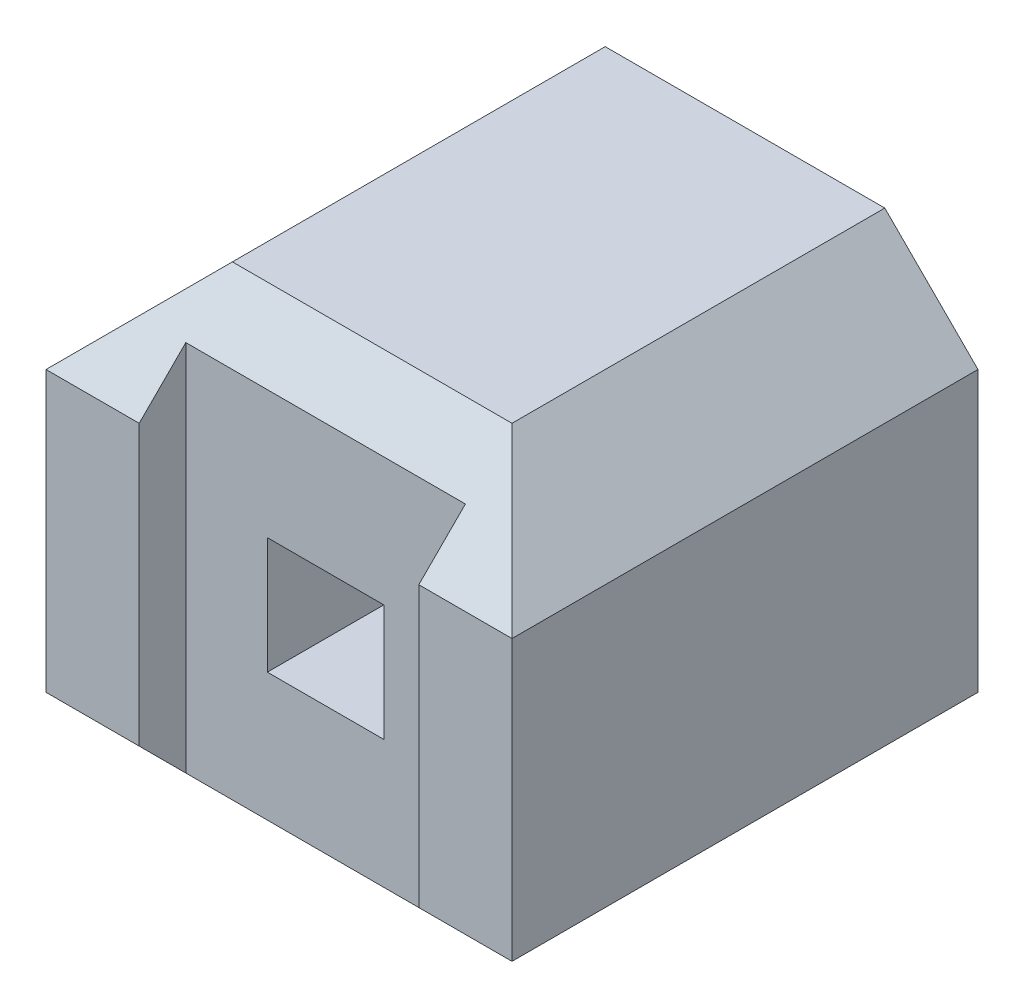
ISO-10303-21;
HEADER;
FILE_DESCRIPTION(('STEP AP214'),'2;1');
FILE_NAME('part.step','',(''),(''),'','','');
FILE_SCHEMA(('AUTOMOTIVE_DESIGN { 1 0 10303 214 1 1 1 1 }'));
ENDSEC;
DATA;
#1=APPLICATION_CONTEXT('core data for automotive mechanical design processes');
#2=APPLICATION_PROTOCOL_DEFINITION('international standard','automotive_design',2000,#1);
#3=PRODUCT_CONTEXT('',#1,'mechanical');
#4=PRODUCT('Part','Part','',(#3));
#5=PRODUCT_RELATED_PRODUCT_CATEGORY('part','',(#4));
#6=PRODUCT_DEFINITION_FORMATION('','',#4);
#7=PRODUCT_DEFINITION_CONTEXT('part definition',#1,'design');
#8=PRODUCT_DEFINITION('design','',#6,#7);
#9=PRODUCT_DEFINITION_SHAPE('','',#8);
#10=(LENGTH_UNIT() NAMED_UNIT(*) SI_UNIT(.MILLI.,.METRE.));
#11=(NAMED_UNIT(*) PLANE_ANGLE_UNIT() SI_UNIT($,.RADIAN.));
#12=(NAMED_UNIT(*) SI_UNIT($,.STERADIAN.) SOLID_ANGLE_UNIT());
#13=UNCERTAINTY_MEASURE_WITH_UNIT(LENGTH_MEASURE(1.E-05),#10,'distance_accuracy_value','');
#14=(GEOMETRIC_REPRESENTATION_CONTEXT(3) GLOBAL_UNCERTAINTY_ASSIGNED_CONTEXT((#13)) GLOBAL_UNIT_ASSIGNED_CONTEXT((#10,
#11,#12)) REPRESENTATION_CONTEXT('',''));
#15=CARTESIAN_POINT('',(0.,0.,0.));
#16=DIRECTION('',(0.,0.,1.));
#17=DIRECTION('',(1.,0.,0.));
#18=AXIS2_PLACEMENT_3D('',#15,#16,#17);
#19=CARTESIAN_POINT('',(1.27,-1.27,2.54));
#20=DIRECTION('',(-1.,0.,0.));
#21=DIRECTION('',(0.,0.,1.));
#22=AXIS2_PLACEMENT_3D('',#19,#20,#21);
#23=PLANE('',#22);
#24=DIRECTION('',(0.,0.,1.));
#25=VECTOR('',#24,1.);
#26=CARTESIAN_POINT('',(1.27,0.762,2.54));
#27=LINE('',#26,#25);
#28=CARTESIAN_POINT('',(1.27,0.762,0.));
#29=VERTEX_POINT('',#28);
#30=CARTESIAN_POINT('',(1.27,0.762,2.54));
#31=VERTEX_POINT('',#30);
#32=EDGE_CURVE('E158',#29,#31,#27,.T.);
#33=ORIENTED_EDGE('',*,*,#32,.T.);
#34=DIRECTION('',(0.,1.,0.));
#35=VECTOR('',#34,1.);
#36=CARTESIAN_POINT('',(1.27,0.,2.54));
#37=LINE('',#36,#35);
#38=CARTESIAN_POINT('',(1.27,-0.762,2.54));
#39=VERTEX_POINT('',#38);
#40=EDGE_CURVE('E127',#39,#31,#37,.T.);
#41=ORIENTED_EDGE('',*,*,#40,.F.);
#42=DIRECTION('',(0.,0.,1.));
#43=VECTOR('',#42,1.);
#44=CARTESIAN_POINT('',(1.27,-0.762,2.54));
#45=LINE('',#44,#43);
#46=CARTESIAN_POINT('',(1.27,-0.762,0.));
#47=VERTEX_POINT('',#46);
#48=EDGE_CURVE('E151',#39,#47,#45,.F.);
#49=ORIENTED_EDGE('',*,*,#48,.T.);
#50=DIRECTION('',(0.,1.,0.));
#51=VECTOR('',#50,1.);
#52=CARTESIAN_POINT('',(1.27,-1.27,0.));
#53=LINE('',#52,#51);
#54=EDGE_CURVE('E19',#29,#47,#53,.F.);
#55=ORIENTED_EDGE('',*,*,#54,.F.);
#56=EDGE_LOOP('',(#33,#41,#49,#55));
#57=FACE_BOUND('',#56,.T.);
#58=ADVANCED_FACE('F16',(#57),#23,.F.);
#59=CARTESIAN_POINT('',(0.,0.,2.54));
#60=DIRECTION('',(0.,0.,1.));
#61=DIRECTION('',(1.,0.,0.));
#62=AXIS2_PLACEMENT_3D('',#59,#60,#61);
#63=PLANE('',#62);
#64=ORIENTED_EDGE('',*,*,#40,.T.);
#65=DIRECTION('',(1.,0.,0.));
#66=VECTOR('',#65,1.);
#67=CARTESIAN_POINT('',(0.,0.762,2.54));
#68=LINE('',#67,#66);
#69=CARTESIAN_POINT('',(0.762,0.762,2.54));
#70=VERTEX_POINT('',#69);
#71=EDGE_CURVE('E155',#31,#70,#68,.F.);
#72=ORIENTED_EDGE('',*,*,#71,.T.);
#73=DIRECTION('',(0.,-1.,0.));
#74=VECTOR('',#73,1.);
#75=CARTESIAN_POINT('',(0.762,1.27,2.54));
#76=LINE('',#75,#74);
#77=CARTESIAN_POINT('',(0.762,-0.762,2.54));
#78=VERTEX_POINT('',#77);
#79=EDGE_CURVE('E134',#78,#70,#76,.F.);
#80=ORIENTED_EDGE('',*,*,#79,.F.);
#81=DIRECTION('',(1.,0.,0.));
#82=VECTOR('',#81,1.);
#83=CARTESIAN_POINT('',(0.,-0.762,2.54));
#84=LINE('',#83,#82);
#85=EDGE_CURVE('E130',#78,#39,#84,.T.);
#86=ORIENTED_EDGE('',*,*,#85,.T.);
#87=EDGE_LOOP('',(#64,#72,#80,#86));
#88=FACE_BOUND('',#87,.T.);
#89=ADVANCED_FACE('F132',(#88),#63,.T.);
#90=CARTESIAN_POINT('',(1.27,-0.762,2.54));
#91=DIRECTION('',(-0.707106781186548,0.707106781186547,0.));
#92=DIRECTION('',(-0.707106781186547,-0.707106781186548,0.));
#93=AXIS2_PLACEMENT_3D('',#90,#91,#92);
#94=PLANE('',#93);
#95=ORIENTED_EDGE('',*,*,#48,.F.);
#96=DIRECTION('',(0.577350269189626,0.577350269189625,0.577350269189626));
#97=VECTOR('',#96,1.);
#98=CARTESIAN_POINT('',(0.762,-1.27,2.032));
#99=LINE('',#98,#97);
#100=CARTESIAN_POINT('',(0.762,-1.27,2.032));
#101=VERTEX_POINT('',#100);
#102=EDGE_CURVE('E138',#101,#39,#99,.T.);
#103=ORIENTED_EDGE('',*,*,#102,.F.);
#104=DIRECTION('',(0.,0.,1.));
#105=VECTOR('',#104,1.);
#106=CARTESIAN_POINT('',(0.762,-1.27,2.54));
#107=LINE('',#106,#105);
#108=CARTESIAN_POINT('',(0.762,-1.27,0.));
#109=VERTEX_POINT('',#108);
#110=EDGE_CURVE('E182',#101,#109,#107,.F.);
#111=ORIENTED_EDGE('',*,*,#110,.T.);
#112=DIRECTION('',(-0.707106781186547,-0.707106781186548,0.));
#113=VECTOR('',#112,1.);
#114=CARTESIAN_POINT('',(1.27,-0.762,0.));
#115=LINE('',#114,#113);
#116=EDGE_CURVE('E153',#47,#109,#115,.T.);
#117=ORIENTED_EDGE('',*,*,#116,.F.);
#118=EDGE_LOOP('',(#95,#103,#111,#117));
#119=FACE_BOUND('',#118,.T.);
#120=ADVANCED_FACE('F152',(#119),#94,.F.);
#121=CARTESIAN_POINT('',(0.762,1.27,2.54));
#122=DIRECTION('',(-0.707106781186548,-0.707106781186547,0.));
#123=DIRECTION('',(0.707106781186547,-0.707106781186548,0.));
#124=AXIS2_PLACEMENT_3D('',#121,#122,#123);
#125=PLANE('',#124);
#126=DIRECTION('',(0.,0.,-1.));
#127=VECTOR('',#126,1.);
#128=CARTESIAN_POINT('',(0.762,1.27,2.54));
#129=LINE('',#128,#127);
#130=CARTESIAN_POINT('',(0.762,1.27,0.));
#131=VERTEX_POINT('',#130);
#132=CARTESIAN_POINT('',(0.762,1.27,2.032));
#133=VERTEX_POINT('',#132);
#134=EDGE_CURVE('E186',#131,#133,#129,.F.);
#135=ORIENTED_EDGE('',*,*,#134,.T.);
#136=DIRECTION('',(-0.577350269189625,0.577350269189626,-0.577350269189626));
#137=VECTOR('',#136,1.);
#138=CARTESIAN_POINT('',(1.27,0.762,2.54));
#139=LINE('',#138,#137);
#140=EDGE_CURVE('E165',#31,#133,#139,.T.);
#141=ORIENTED_EDGE('',*,*,#140,.F.);
#142=ORIENTED_EDGE('',*,*,#32,.F.);
#143=DIRECTION('',(0.707106781186547,-0.707106781186548,0.));
#144=VECTOR('',#143,1.);
#145=CARTESIAN_POINT('',(0.762,1.27,0.));
#146=LINE('',#145,#144);
#147=EDGE_CURVE('E167',#131,#29,#146,.T.);
#148=ORIENTED_EDGE('',*,*,#147,.F.);
#149=EDGE_LOOP('',(#135,#141,#142,#148));
#150=FACE_BOUND('',#149,.T.);
#151=ADVANCED_FACE('F357',(#150),#125,.F.);
#152=CARTESIAN_POINT('',(0.762,1.27,2.286));
#153=DIRECTION('',(-1.,0.,0.));
#154=DIRECTION('',(0.,-1.,0.));
#155=AXIS2_PLACEMENT_3D('',#152,#153,#154);
#156=PLANE('',#155);
#157=ORIENTED_EDGE('',*,*,#79,.T.);
#158=DIRECTION('',(0.,-0.707106781186547,0.707106781186548));
#159=VECTOR('',#158,1.);
#160=CARTESIAN_POINT('',(0.762,0.762,2.54));
#161=LINE('',#160,#159);
#162=CARTESIAN_POINT('',(0.762,1.016,2.286));
#163=VERTEX_POINT('',#162);
#164=EDGE_CURVE('E196',#163,#70,#161,.T.);
#165=ORIENTED_EDGE('',*,*,#164,.F.);
#166=DIRECTION('',(0.,1.,0.));
#167=VECTOR('',#166,1.);
#168=CARTESIAN_POINT('',(0.762,0.,2.286));
#169=LINE('',#168,#167);
#170=CARTESIAN_POINT('',(0.762,-1.016,2.286));
#171=VERTEX_POINT('',#170);
#172=EDGE_CURVE('E211',#163,#171,#169,.F.);
#173=ORIENTED_EDGE('',*,*,#172,.T.);
#174=DIRECTION('',(0.,-0.707106781186547,-0.707106781186548));
#175=VECTOR('',#174,1.);
#176=CARTESIAN_POINT('',(0.762,-0.762,2.54));
#177=LINE('',#176,#175);
#178=EDGE_CURVE('E146',#78,#171,#177,.T.);
#179=ORIENTED_EDGE('',*,*,#178,.F.);
#180=EDGE_LOOP('',(#157,#165,#173,#179));
#181=FACE_BOUND('',#180,.T.);
#182=ADVANCED_FACE('F292',(#181),#156,.T.);
#183=CARTESIAN_POINT('',(-0.762,-1.27,2.286));
#184=DIRECTION('',(1.,0.,0.));
#185=DIRECTION('',(0.,0.,-1.));
#186=AXIS2_PLACEMENT_3D('',#183,#184,#185);
#187=PLANE('',#186);
#188=DIRECTION('',(0.,1.,0.));
#189=VECTOR('',#188,1.);
#190=CARTESIAN_POINT('',(-0.762,0.,2.286));
#191=LINE('',#190,#189);
#192=CARTESIAN_POINT('',(-0.762,-1.016,2.286));
#193=VERTEX_POINT('',#192);
#194=CARTESIAN_POINT('',(-0.762,1.016,2.286));
#195=VERTEX_POINT('',#194);
#196=EDGE_CURVE('E217',#193,#195,#191,.T.);
#197=ORIENTED_EDGE('',*,*,#196,.T.);
#198=DIRECTION('',(0.,-0.707106781186547,0.707106781186548));
#199=VECTOR('',#198,1.);
#200=CARTESIAN_POINT('',(-0.762,0.762,2.54));
#201=LINE('',#200,#199);
#202=CARTESIAN_POINT('',(-0.762,0.762,2.54));
#203=VERTEX_POINT('',#202);
#204=EDGE_CURVE('E194',#203,#195,#201,.F.);
#205=ORIENTED_EDGE('',*,*,#204,.F.);
#206=DIRECTION('',(0.,1.,0.));
#207=VECTOR('',#206,1.);
#208=CARTESIAN_POINT('',(-0.762,-1.27,2.54));
#209=LINE('',#208,#207);
#210=CARTESIAN_POINT('',(-0.762,-0.762,2.54));
#211=VERTEX_POINT('',#210);
#212=EDGE_CURVE('E171',#203,#211,#209,.F.);
#213=ORIENTED_EDGE('',*,*,#212,.T.);
#214=DIRECTION('',(0.,-0.707106781186547,-0.707106781186548));
#215=VECTOR('',#214,1.);
#216=CARTESIAN_POINT('',(-0.762,-0.762,2.54));
#217=LINE('',#216,#215);
#218=EDGE_CURVE('E176',#193,#211,#217,.F.);
#219=ORIENTED_EDGE('',*,*,#218,.F.);
#220=EDGE_LOOP('',(#197,#205,#213,#219));
#221=FACE_BOUND('',#220,.T.);
#222=ADVANCED_FACE('F283',(#221),#187,.T.);
#223=CARTESIAN_POINT('',(0.3175,-0.3175,2.794));
#224=DIRECTION('',(0.,-1.,0.));
#225=DIRECTION('',(0.,0.,-1.));
#226=AXIS2_PLACEMENT_3D('',#223,#224,#225);
#227=PLANE('',#226);
#228=DIRECTION('',(-1.,0.,0.));
#229=VECTOR('',#228,1.);
#230=CARTESIAN_POINT('',(0.,-0.3175,2.286));
#231=LINE('',#230,#229);
#232=CARTESIAN_POINT('',(-0.3175,-0.3175,2.286));
#233=VERTEX_POINT('',#232);
#234=CARTESIAN_POINT('',(0.3175,-0.3175,2.286));
#235=VERTEX_POINT('',#234);
#236=EDGE_CURVE('E209',#233,#235,#231,.F.);
#237=ORIENTED_EDGE('',*,*,#236,.T.);
#238=DIRECTION('',(0.,0.,-1.));
#239=VECTOR('',#238,1.);
#240=CARTESIAN_POINT('',(0.3175,-0.3175,2.794));
#241=LINE('',#240,#239);
#242=CARTESIAN_POINT('',(0.3175,-0.3175,0.));
#243=VERTEX_POINT('',#242);
#244=EDGE_CURVE('E228',#235,#243,#241,.T.);
#245=ORIENTED_EDGE('',*,*,#244,.T.);
#246=DIRECTION('',(1.,0.,0.));
#247=VECTOR('',#246,1.);
#248=CARTESIAN_POINT('',(0.3175,-0.3175,0.));
#249=LINE('',#248,#247);
#250=CARTESIAN_POINT('',(-0.3175,-0.3175,0.));
#251=VERTEX_POINT('',#250);
#252=EDGE_CURVE('E173',#251,#243,#249,.T.);
#253=ORIENTED_EDGE('',*,*,#252,.F.);
#254=DIRECTION('',(0.,0.,1.));
#255=VECTOR('',#254,1.);
#256=CARTESIAN_POINT('',(-0.3175,-0.3175,2.794));
#257=LINE('',#256,#255);
#258=EDGE_CURVE('E204',#251,#233,#257,.T.);
#259=ORIENTED_EDGE('',*,*,#258,.T.);
#260=EDGE_LOOP('',(#237,#245,#253,#259));
#261=FACE_BOUND('',#260,.T.);
#262=ADVANCED_FACE('F281',(#261),#227,.F.);
#263=CARTESIAN_POINT('',(0.,-0.762,2.54));
#264=DIRECTION('',(0.,-0.707106781186548,0.707106781186547));
#265=DIRECTION('',(0.,-0.707106781186547,-0.707106781186548));
#266=AXIS2_PLACEMENT_3D('',#263,#264,#265);
#267=PLANE('',#266);
#268=ORIENTED_EDGE('',*,*,#85,.F.);
#269=ORIENTED_EDGE('',*,*,#178,.T.);
#270=DIRECTION('',(-1.,0.,0.));
#271=VECTOR('',#270,1.);
#272=CARTESIAN_POINT('',(0.,-1.016,2.286));
#273=LINE('',#272,#271);
#274=EDGE_CURVE('E214',#171,#193,#273,.T.);
#275=ORIENTED_EDGE('',*,*,#274,.T.);
#276=ORIENTED_EDGE('',*,*,#218,.T.);
#277=DIRECTION('',(1.,0.,0.));
#278=VECTOR('',#277,1.);
#279=CARTESIAN_POINT('',(0.,-0.762,2.54));
#280=LINE('',#279,#278);
#281=CARTESIAN_POINT('',(-1.27,-0.762,2.54));
#282=VERTEX_POINT('',#281);
#283=EDGE_CURVE('E147',#211,#282,#280,.F.);
#284=ORIENTED_EDGE('',*,*,#283,.T.);
#285=DIRECTION('',(0.577350269189625,-0.577350269189626,-0.577350269189626));
#286=VECTOR('',#285,1.);
#287=CARTESIAN_POINT('',(-1.27,-0.762,2.54));
#288=LINE('',#287,#286);
#289=CARTESIAN_POINT('',(-0.762,-1.27,2.032));
#290=VERTEX_POINT('',#289);
#291=EDGE_CURVE('E231',#282,#290,#288,.T.);
#292=ORIENTED_EDGE('',*,*,#291,.T.);
#293=DIRECTION('',(1.,0.,0.));
#294=VECTOR('',#293,1.);
#295=CARTESIAN_POINT('',(-1.27,-1.27,2.032));
#296=LINE('',#295,#294);
#297=EDGE_CURVE('E142',#290,#101,#296,.T.);
#298=ORIENTED_EDGE('',*,*,#297,.T.);
#299=ORIENTED_EDGE('',*,*,#102,.T.);
#300=EDGE_LOOP('',(#268,#269,#275,#276,#284,#292,#298,#299));
#301=FACE_BOUND('',#300,.T.);
#302=ADVANCED_FACE('F140',(#301),#267,.T.);
#303=CARTESIAN_POINT('',(-1.27,-1.27,2.54));
#304=DIRECTION('',(0.,1.,0.));
#305=DIRECTION('',(0.,0.,1.));
#306=AXIS2_PLACEMENT_3D('',#303,#304,#305);
#307=PLANE('',#306);
#308=ORIENTED_EDGE('',*,*,#110,.F.);
#309=ORIENTED_EDGE('',*,*,#297,.F.);
#310=DIRECTION('',(0.,0.,1.));
#311=VECTOR('',#310,1.);
#312=CARTESIAN_POINT('',(-0.762,-1.27,2.54));
#313=LINE('',#312,#311);
#314=CARTESIAN_POINT('',(-0.762,-1.27,0.));
#315=VERTEX_POINT('',#314);
#316=EDGE_CURVE('E233',#290,#315,#313,.F.);
#317=ORIENTED_EDGE('',*,*,#316,.T.);
#318=DIRECTION('',(1.,0.,0.));
#319=VECTOR('',#318,1.);
#320=CARTESIAN_POINT('',(-1.27,-1.27,0.));
#321=LINE('',#320,#319);
#322=EDGE_CURVE('E184',#109,#315,#321,.F.);
#323=ORIENTED_EDGE('',*,*,#322,.F.);
#324=EDGE_LOOP('',(#308,#309,#317,#323));
#325=FACE_BOUND('',#324,.T.);
#326=ADVANCED_FACE('F290',(#325),#307,.F.);
#327=CARTESIAN_POINT('',(1.27,1.27,2.54));
#328=DIRECTION('',(0.,-1.,0.));
#329=DIRECTION('',(0.,0.,-1.));
#330=AXIS2_PLACEMENT_3D('',#327,#328,#329);
#331=PLANE('',#330);
#332=DIRECTION('',(0.,0.,1.));
#333=VECTOR('',#332,1.);
#334=CARTESIAN_POINT('',(-0.762,1.27,2.54));
#335=LINE('',#334,#333);
#336=CARTESIAN_POINT('',(-0.762,1.27,0.));
#337=VERTEX_POINT('',#336);
#338=CARTESIAN_POINT('',(-0.762,1.27,2.032));
#339=VERTEX_POINT('',#338);
#340=EDGE_CURVE('E238',#337,#339,#335,.T.);
#341=ORIENTED_EDGE('',*,*,#340,.T.);
#342=DIRECTION('',(1.,0.,0.));
#343=VECTOR('',#342,1.);
#344=CARTESIAN_POINT('',(0.,1.27,2.032));
#345=LINE('',#344,#343);
#346=EDGE_CURVE('E199',#133,#339,#345,.F.);
#347=ORIENTED_EDGE('',*,*,#346,.F.);
#348=ORIENTED_EDGE('',*,*,#134,.F.);
#349=DIRECTION('',(1.,0.,0.));
#350=VECTOR('',#349,1.);
#351=CARTESIAN_POINT('',(1.27,1.27,0.));
#352=LINE('',#351,#350);
#353=EDGE_CURVE('E189',#337,#131,#352,.T.);
#354=ORIENTED_EDGE('',*,*,#353,.F.);
#355=EDGE_LOOP('',(#341,#347,#348,#354));
#356=FACE_BOUND('',#355,.T.);
#357=ADVANCED_FACE('F328',(#356),#331,.F.);
#358=CARTESIAN_POINT('',(0.,0.762,2.54));
#359=DIRECTION('',(0.,0.707106781186548,0.707106781186547));
#360=DIRECTION('',(0.,-0.707106781186547,0.707106781186548));
#361=AXIS2_PLACEMENT_3D('',#358,#359,#360);
#362=PLANE('',#361);
#363=ORIENTED_EDGE('',*,*,#346,.T.);
#364=DIRECTION('',(-0.577350269189625,-0.577350269189626,0.577350269189626));
#365=VECTOR('',#364,1.);
#366=CARTESIAN_POINT('',(-0.762,1.27,2.032));
#367=LINE('',#366,#365);
#368=CARTESIAN_POINT('',(-1.27,0.762,2.54));
#369=VERTEX_POINT('',#368);
#370=EDGE_CURVE('E241',#339,#369,#367,.T.);
#371=ORIENTED_EDGE('',*,*,#370,.T.);
#372=DIRECTION('',(1.,0.,0.));
#373=VECTOR('',#372,1.);
#374=CARTESIAN_POINT('',(0.,0.762,2.54));
#375=LINE('',#374,#373);
#376=EDGE_CURVE('E192',#369,#203,#375,.T.);
#377=ORIENTED_EDGE('',*,*,#376,.T.);
#378=ORIENTED_EDGE('',*,*,#204,.T.);
#379=DIRECTION('',(-1.,0.,0.));
#380=VECTOR('',#379,1.);
#381=CARTESIAN_POINT('',(0.,1.016,2.286));
#382=LINE('',#381,#380);
#383=EDGE_CURVE('E220',#195,#163,#382,.F.);
#384=ORIENTED_EDGE('',*,*,#383,.T.);
#385=ORIENTED_EDGE('',*,*,#164,.T.);
#386=ORIENTED_EDGE('',*,*,#71,.F.);
#387=ORIENTED_EDGE('',*,*,#140,.T.);
#388=EDGE_LOOP('',(#363,#371,#377,#378,#384,#385,#386,#387));
#389=FACE_BOUND('',#388,.T.);
#390=ADVANCED_FACE('F325',(#389),#362,.T.);
#391=CARTESIAN_POINT('',(-0.3175,-0.3175,2.794));
#392=DIRECTION('',(-1.,0.,0.));
#393=DIRECTION('',(0.,0.,1.));
#394=AXIS2_PLACEMENT_3D('',#391,#392,#393);
#395=PLANE('',#394);
#396=DIRECTION('',(0.,1.,0.));
#397=VECTOR('',#396,1.);
#398=CARTESIAN_POINT('',(-0.3175,0.,2.286));
#399=LINE('',#398,#397);
#400=CARTESIAN_POINT('',(-0.3175,0.3175,2.286));
#401=VERTEX_POINT('',#400);
#402=EDGE_CURVE('E206',#401,#233,#399,.F.);
#403=ORIENTED_EDGE('',*,*,#402,.T.);
#404=ORIENTED_EDGE('',*,*,#258,.F.);
#405=DIRECTION('',(0.,1.,0.));
#406=VECTOR('',#405,1.);
#407=CARTESIAN_POINT('',(-0.3175,-0.3175,0.));
#408=LINE('',#407,#406);
#409=CARTESIAN_POINT('',(-0.3175,0.3175,0.));
#410=VERTEX_POINT('',#409);
#411=EDGE_CURVE('E201',#410,#251,#408,.F.);
#412=ORIENTED_EDGE('',*,*,#411,.F.);
#413=DIRECTION('',(0.,0.,1.));
#414=VECTOR('',#413,1.);
#415=CARTESIAN_POINT('',(-0.3175,0.3175,2.794));
#416=LINE('',#415,#414);
#417=EDGE_CURVE('E245',#410,#401,#416,.T.);
#418=ORIENTED_EDGE('',*,*,#417,.T.);
#419=EDGE_LOOP('',(#403,#404,#412,#418));
#420=FACE_BOUND('',#419,.T.);
#421=ADVANCED_FACE('F278',(#420),#395,.F.);
#422=CARTESIAN_POINT('',(0.,0.,2.286));
#423=DIRECTION('',(0.,0.,-1.));
#424=DIRECTION('',(-1.,0.,0.));
#425=AXIS2_PLACEMENT_3D('',#422,#423,#424);
#426=PLANE('',#425);
#427=ORIENTED_EDGE('',*,*,#196,.F.);
#428=ORIENTED_EDGE('',*,*,#274,.F.);
#429=ORIENTED_EDGE('',*,*,#172,.F.);
#430=ORIENTED_EDGE('',*,*,#383,.F.);
#431=EDGE_LOOP('',(#427,#428,#429,#430));
#432=FACE_BOUND('',#431,.T.);
#433=ORIENTED_EDGE('',*,*,#402,.F.);
#434=DIRECTION('',(1.,0.,0.));
#435=VECTOR('',#434,1.);
#436=CARTESIAN_POINT('',(-0.3175,0.3175,2.286));
#437=LINE('',#436,#435);
#438=CARTESIAN_POINT('',(0.3175,0.3175,2.286));
#439=VERTEX_POINT('',#438);
#440=EDGE_CURVE('E248',#401,#439,#437,.T.);
#441=ORIENTED_EDGE('',*,*,#440,.T.);
#442=DIRECTION('',(0.,1.,0.));
#443=VECTOR('',#442,1.);
#444=CARTESIAN_POINT('',(0.3175,0.3175,2.286));
#445=LINE('',#444,#443);
#446=EDGE_CURVE('E225',#439,#235,#445,.F.);
#447=ORIENTED_EDGE('',*,*,#446,.T.);
#448=ORIENTED_EDGE('',*,*,#236,.F.);
#449=EDGE_LOOP('',(#433,#441,#447,#448));
#450=FACE_BOUND('',#449,.T.);
#451=ADVANCED_FACE('F276',(#432,#450),#426,.F.);
#452=CARTESIAN_POINT('',(0.3175,0.3175,2.794));
#453=DIRECTION('',(1.,0.,0.));
#454=DIRECTION('',(0.,0.,-1.));
#455=AXIS2_PLACEMENT_3D('',#452,#453,#454);
#456=PLANE('',#455);
#457=ORIENTED_EDGE('',*,*,#446,.F.);
#458=DIRECTION('',(0.,0.,1.));
#459=VECTOR('',#458,1.);
#460=CARTESIAN_POINT('',(0.3175,0.3175,2.794));
#461=LINE('',#460,#459);
#462=CARTESIAN_POINT('',(0.3175,0.3175,0.));
#463=VERTEX_POINT('',#462);
#464=EDGE_CURVE('E251',#439,#463,#461,.F.);
#465=ORIENTED_EDGE('',*,*,#464,.T.);
#466=DIRECTION('',(0.,1.,0.));
#467=VECTOR('',#466,1.);
#468=CARTESIAN_POINT('',(0.3175,0.3175,0.));
#469=LINE('',#468,#467);
#470=EDGE_CURVE('E223',#243,#463,#469,.T.);
#471=ORIENTED_EDGE('',*,*,#470,.F.);
#472=ORIENTED_EDGE('',*,*,#244,.F.);
#473=EDGE_LOOP('',(#457,#465,#471,#472));
#474=FACE_BOUND('',#473,.T.);
#475=ADVANCED_FACE('F273',(#474),#456,.F.);
#476=CARTESIAN_POINT('',(-0.762,-1.27,2.54));
#477=DIRECTION('',(0.707106781186548,0.707106781186547,0.));
#478=DIRECTION('',(-0.707106781186547,0.707106781186548,0.));
#479=AXIS2_PLACEMENT_3D('',#476,#477,#478);
#480=PLANE('',#479);
#481=ORIENTED_EDGE('',*,*,#316,.F.);
#482=ORIENTED_EDGE('',*,*,#291,.F.);
#483=DIRECTION('',(0.,0.,-1.));
#484=VECTOR('',#483,1.);
#485=CARTESIAN_POINT('',(-1.27,-0.762,2.54));
#486=LINE('',#485,#484);
#487=CARTESIAN_POINT('',(-1.27,-0.762,0.));
#488=VERTEX_POINT('',#487);
#489=EDGE_CURVE('E254',#282,#488,#486,.T.);
#490=ORIENTED_EDGE('',*,*,#489,.T.);
#491=DIRECTION('',(-0.707106781186547,0.707106781186548,0.));
#492=VECTOR('',#491,1.);
#493=CARTESIAN_POINT('',(-0.762,-1.27,0.));
#494=LINE('',#493,#492);
#495=EDGE_CURVE('E236',#315,#488,#494,.T.);
#496=ORIENTED_EDGE('',*,*,#495,.F.);
#497=EDGE_LOOP('',(#481,#482,#490,#496));
#498=FACE_BOUND('',#497,.T.);
#499=ADVANCED_FACE('F314',(#498),#480,.F.);
#500=CARTESIAN_POINT('',(-1.27,0.762,2.54));
#501=DIRECTION('',(0.707106781186548,-0.707106781186547,0.));
#502=DIRECTION('',(0.707106781186547,0.707106781186548,0.));
#503=AXIS2_PLACEMENT_3D('',#500,#501,#502);
#504=PLANE('',#503);
#505=DIRECTION('',(0.,0.,-1.));
#506=VECTOR('',#505,1.);
#507=CARTESIAN_POINT('',(-1.27,0.762,2.54));
#508=LINE('',#507,#506);
#509=CARTESIAN_POINT('',(-1.27,0.762,0.));
#510=VERTEX_POINT('',#509);
#511=EDGE_CURVE('E257',#510,#369,#508,.F.);
#512=ORIENTED_EDGE('',*,*,#511,.T.);
#513=ORIENTED_EDGE('',*,*,#370,.F.);
#514=ORIENTED_EDGE('',*,*,#340,.F.);
#515=DIRECTION('',(0.707106781186547,0.707106781186548,0.));
#516=VECTOR('',#515,1.);
#517=CARTESIAN_POINT('',(-1.27,0.762,0.));
#518=LINE('',#517,#516);
#519=EDGE_CURVE('E34',#510,#337,#518,.T.);
#520=ORIENTED_EDGE('',*,*,#519,.F.);
#521=EDGE_LOOP('',(#512,#513,#514,#520));
#522=FACE_BOUND('',#521,.T.);
#523=ADVANCED_FACE('F310',(#522),#504,.F.);
#524=CARTESIAN_POINT('',(0.,0.,2.54));
#525=DIRECTION('',(0.,0.,1.));
#526=DIRECTION('',(1.,0.,0.));
#527=AXIS2_PLACEMENT_3D('',#524,#525,#526);
#528=PLANE('',#527);
#529=DIRECTION('',(0.,1.,0.));
#530=VECTOR('',#529,1.);
#531=CARTESIAN_POINT('',(-1.27,1.27,2.54));
#532=LINE('',#531,#530);
#533=EDGE_CURVE('E259',#369,#282,#532,.F.);
#534=ORIENTED_EDGE('',*,*,#533,.T.);
#535=ORIENTED_EDGE('',*,*,#283,.F.);
#536=ORIENTED_EDGE('',*,*,#212,.F.);
#537=ORIENTED_EDGE('',*,*,#376,.F.);
#538=EDGE_LOOP('',(#534,#535,#536,#537));
#539=FACE_BOUND('',#538,.T.);
#540=ADVANCED_FACE('F307',(#539),#528,.T.);
#541=CARTESIAN_POINT('',(-0.3175,0.3175,2.794));
#542=DIRECTION('',(0.,1.,0.));
#543=DIRECTION('',(0.,0.,1.));
#544=AXIS2_PLACEMENT_3D('',#541,#542,#543);
#545=PLANE('',#544);
#546=ORIENTED_EDGE('',*,*,#440,.F.);
#547=ORIENTED_EDGE('',*,*,#417,.F.);
#548=DIRECTION('',(1.,0.,0.));
#549=VECTOR('',#548,1.);
#550=CARTESIAN_POINT('',(0.,0.3175,0.));
#551=LINE('',#550,#549);
#552=EDGE_CURVE('E25',#410,#463,#551,.T.);
#553=ORIENTED_EDGE('',*,*,#552,.T.);
#554=ORIENTED_EDGE('',*,*,#464,.F.);
#555=EDGE_LOOP('',(#546,#547,#553,#554));
#556=FACE_BOUND('',#555,.T.);
#557=ADVANCED_FACE('F268',(#556),#545,.F.);
#558=CARTESIAN_POINT('',(-1.27,1.27,2.54));
#559=DIRECTION('',(1.,0.,0.));
#560=DIRECTION('',(0.,0.,-1.));
#561=AXIS2_PLACEMENT_3D('',#558,#559,#560);
#562=PLANE('',#561);
#563=ORIENTED_EDGE('',*,*,#511,.F.);
#564=DIRECTION('',(0.,1.,0.));
#565=VECTOR('',#564,1.);
#566=CARTESIAN_POINT('',(-1.27,0.,0.));
#567=LINE('',#566,#565);
#568=EDGE_CURVE('E11',#510,#488,#567,.F.);
#569=ORIENTED_EDGE('',*,*,#568,.T.);
#570=ORIENTED_EDGE('',*,*,#489,.F.);
#571=ORIENTED_EDGE('',*,*,#533,.F.);
#572=EDGE_LOOP('',(#563,#569,#570,#571));
#573=FACE_BOUND('',#572,.T.);
#574=ADVANCED_FACE('F296',(#573),#562,.F.);
#575=CARTESIAN_POINT('',(0.,0.,0.));
#576=DIRECTION('',(0.,0.,1.));
#577=DIRECTION('',(1.,0.,0.));
#578=AXIS2_PLACEMENT_3D('',#575,#576,#577);
#579=PLANE('',#578);
#580=ORIENTED_EDGE('',*,*,#519,.T.);
#581=ORIENTED_EDGE('',*,*,#353,.T.);
#582=ORIENTED_EDGE('',*,*,#147,.T.);
#583=ORIENTED_EDGE('',*,*,#54,.T.);
#584=ORIENTED_EDGE('',*,*,#116,.T.);
#585=ORIENTED_EDGE('',*,*,#322,.T.);
#586=ORIENTED_EDGE('',*,*,#495,.T.);
#587=ORIENTED_EDGE('',*,*,#568,.F.);
#588=EDGE_LOOP('',(#580,#581,#582,#583,#584,#585,#586,#587));
#589=FACE_BOUND('',#588,.T.);
#590=ORIENTED_EDGE('',*,*,#411,.T.);
#591=ORIENTED_EDGE('',*,*,#252,.T.);
#592=ORIENTED_EDGE('',*,*,#470,.T.);
#593=ORIENTED_EDGE('',*,*,#552,.F.);
#594=EDGE_LOOP('',(#590,#591,#592,#593));
#595=FACE_BOUND('',#594,.T.);
#596=ADVANCED_FACE('F270',(#589,#595),#579,.F.);
#597=CLOSED_SHELL('',(#58,#89,#120,#151,#182,#222,#262,#302,#326,#357,#390,#421,#451,#475,#499,
#523,#540,#557,#574,#596));
#598=MANIFOLD_SOLID_BREP('B1',#597);
#599=ADVANCED_BREP_SHAPE_REPRESENTATION('',(#18,#598),#14);
#600=SHAPE_DEFINITION_REPRESENTATION(#9,#599);
ENDSEC;
END-ISO-10303-21;
